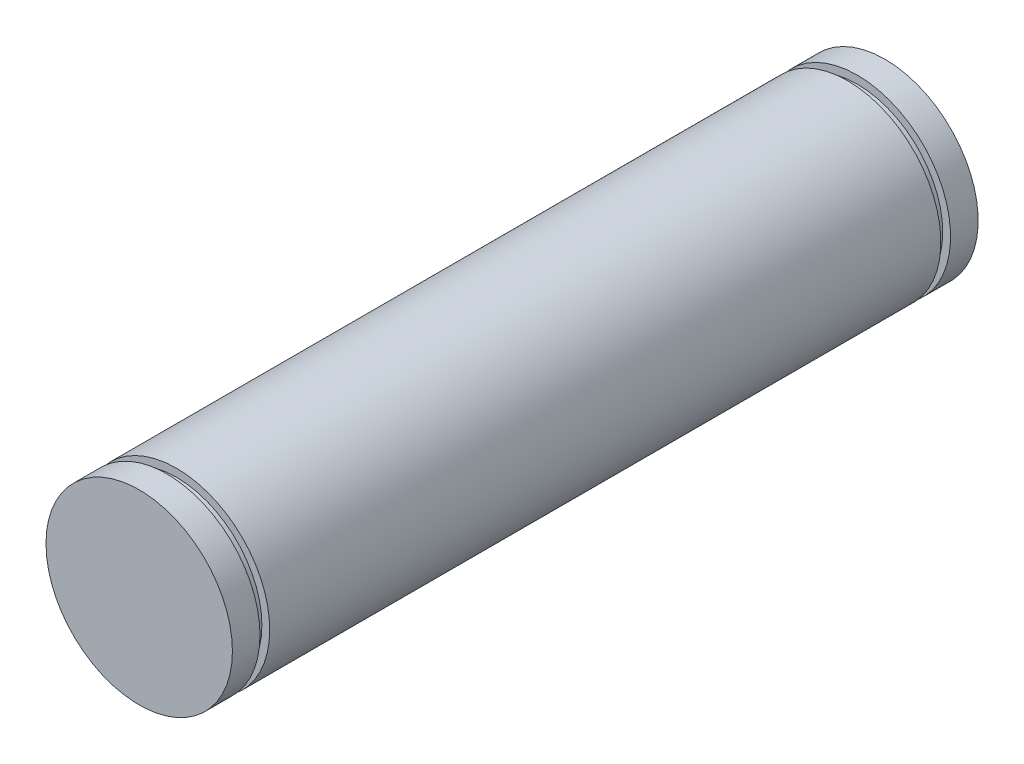
ISO-10303-21;
HEADER;
FILE_DESCRIPTION(('STEP AP214'),'2;1');
FILE_NAME('part.step','',(''),(''),'','','');
FILE_SCHEMA(('AUTOMOTIVE_DESIGN { 1 0 10303 214 1 1 1 1 }'));
ENDSEC;
DATA;
#1=APPLICATION_CONTEXT('core data for automotive mechanical design processes');
#2=APPLICATION_PROTOCOL_DEFINITION('international standard','automotive_design',2000,#1);
#3=PRODUCT_CONTEXT('',#1,'mechanical');
#4=PRODUCT('Part','Part','',(#3));
#5=PRODUCT_RELATED_PRODUCT_CATEGORY('part','',(#4));
#6=PRODUCT_DEFINITION_FORMATION('','',#4);
#7=PRODUCT_DEFINITION_CONTEXT('part definition',#1,'design');
#8=PRODUCT_DEFINITION('design','',#6,#7);
#9=PRODUCT_DEFINITION_SHAPE('','',#8);
#10=(LENGTH_UNIT() NAMED_UNIT(*) SI_UNIT(.MILLI.,.METRE.));
#11=(NAMED_UNIT(*) PLANE_ANGLE_UNIT() SI_UNIT($,.RADIAN.));
#12=(NAMED_UNIT(*) SI_UNIT($,.STERADIAN.) SOLID_ANGLE_UNIT());
#13=UNCERTAINTY_MEASURE_WITH_UNIT(LENGTH_MEASURE(1.E-05),#10,'distance_accuracy_value','');
#14=(GEOMETRIC_REPRESENTATION_CONTEXT(3) GLOBAL_UNCERTAINTY_ASSIGNED_CONTEXT((#13)) GLOBAL_UNIT_ASSIGNED_CONTEXT((#10,
#11,#12)) REPRESENTATION_CONTEXT('',''));
#15=CARTESIAN_POINT('',(0.,0.,0.));
#16=DIRECTION('',(0.,0.,1.));
#17=DIRECTION('',(1.,0.,0.));
#18=AXIS2_PLACEMENT_3D('',#15,#16,#17);
#19=CARTESIAN_POINT('',(1309.32481179939,736.635546362911,5508.00000000001));
#20=DIRECTION('',(0.,0.,-1.));
#21=DIRECTION('',(-1.,0.,0.));
#22=AXIS2_PLACEMENT_3D('',#19,#20,#21);
#23=CYLINDRICAL_SURFACE('',#22,12.5);
#24=CARTESIAN_POINT('',(1309.32481179939,736.635546362911,5503.00000000001));
#25=DIRECTION('',(0.,0.,1.));
#26=DIRECTION('',(1.,0.,0.));
#27=AXIS2_PLACEMENT_3D('',#24,#25,#26);
#28=CIRCLE('',#27,12.5);
#29=CARTESIAN_POINT('',(1321.82481179939,736.635546362911,5503.00000000001));
#30=VERTEX_POINT('',#29);
#31=EDGE_CURVE('E51',#30,#30,#28,.T.);
#32=ORIENTED_EDGE('',*,*,#31,.F.);
#33=EDGE_LOOP('',(#32));
#34=FACE_BOUND('',#33,.T.);
#35=CARTESIAN_POINT('',(1309.32481179939,736.635546362911,5413.));
#36=DIRECTION('',(0.,0.,-1.));
#37=DIRECTION('',(0.,1.,0.));
#38=AXIS2_PLACEMENT_3D('',#35,#36,#37);
#39=CIRCLE('',#38,12.5);
#40=CARTESIAN_POINT('',(1309.32481179939,749.135546362911,5413.));
#41=VERTEX_POINT('',#40);
#42=EDGE_CURVE('E56',#41,#41,#39,.T.);
#43=ORIENTED_EDGE('',*,*,#42,.F.);
#44=EDGE_LOOP('',(#43));
#45=FACE_BOUND('',#44,.T.);
#46=ADVANCED_FACE('F34',(#34,#45),#23,.T.);
#47=CARTESIAN_POINT('',(1309.32481179939,736.635546362911,5504.3));
#48=DIRECTION('',(0.,0.,1.));
#49=DIRECTION('',(1.,0.,0.));
#50=AXIS2_PLACEMENT_3D('',#47,#48,#49);
#51=CIRCLE('',#50,12.5);
#52=CARTESIAN_POINT('',(1321.82481179939,736.635546362911,5504.3));
#53=VERTEX_POINT('',#52);
#54=EDGE_CURVE('E47',#53,#53,#51,.T.);
#55=ORIENTED_EDGE('',*,*,#54,.T.);
#56=EDGE_LOOP('',(#55));
#57=FACE_BOUND('',#56,.T.);
#58=CARTESIAN_POINT('',(1309.32481179939,736.635546362911,5508.00000000001));
#59=DIRECTION('',(0.,0.,1.));
#60=DIRECTION('',(1.,0.,0.));
#61=AXIS2_PLACEMENT_3D('',#58,#59,#60);
#62=CIRCLE('',#61,12.5);
#63=CARTESIAN_POINT('',(1321.82481179939,736.635546362911,5508.00000000001));
#64=VERTEX_POINT('',#63);
#65=EDGE_CURVE('E11',#64,#64,#62,.T.);
#66=ORIENTED_EDGE('',*,*,#65,.F.);
#67=EDGE_LOOP('',(#66));
#68=FACE_BOUND('',#67,.T.);
#69=ADVANCED_FACE('F36',(#57,#68),#23,.T.);
#70=CARTESIAN_POINT('',(1309.32481179939,736.635546362911,5508.00000000001));
#71=DIRECTION('',(0.,0.,1.));
#72=DIRECTION('',(1.,0.,0.));
#73=AXIS2_PLACEMENT_3D('',#70,#71,#72);
#74=PLANE('',#73);
#75=ORIENTED_EDGE('',*,*,#65,.T.);
#76=EDGE_LOOP('',(#75));
#77=FACE_BOUND('',#76,.T.);
#78=ADVANCED_FACE('F90',(#77),#74,.T.);
#79=CARTESIAN_POINT('',(1309.32481179939,736.635546362911,5504.3));
#80=DIRECTION('',(0.,0.,1.));
#81=DIRECTION('',(1.,0.,0.));
#82=AXIS2_PLACEMENT_3D('',#79,#80,#81);
#83=PLANE('',#82);
#84=CARTESIAN_POINT('',(1309.32481179939,736.635546362911,5504.3));
#85=DIRECTION('',(0.,0.,1.));
#86=DIRECTION('',(1.,0.,0.));
#87=AXIS2_PLACEMENT_3D('',#84,#85,#86);
#88=CIRCLE('',#87,11.45);
#89=CARTESIAN_POINT('',(1320.77481179939,736.635546362911,5504.3));
#90=VERTEX_POINT('',#89);
#91=EDGE_CURVE('E54',#90,#90,#88,.T.);
#92=ORIENTED_EDGE('',*,*,#91,.T.);
#93=EDGE_LOOP('',(#92));
#94=FACE_BOUND('',#93,.T.);
#95=ORIENTED_EDGE('',*,*,#54,.F.);
#96=EDGE_LOOP('',(#95));
#97=FACE_BOUND('',#96,.T.);
#98=ADVANCED_FACE('F80',(#94,#97),#83,.F.);
#99=CARTESIAN_POINT('',(1309.32481179939,736.635546362911,5503.00000000001));
#100=DIRECTION('',(0.,0.,1.));
#101=DIRECTION('',(1.,0.,0.));
#102=AXIS2_PLACEMENT_3D('',#99,#100,#101);
#103=PLANE('',#102);
#104=CARTESIAN_POINT('',(1309.32481179939,736.635546362911,5503.00000000001));
#105=DIRECTION('',(0.,0.,1.));
#106=DIRECTION('',(1.,0.,0.));
#107=AXIS2_PLACEMENT_3D('',#104,#105,#106);
#108=CIRCLE('',#107,11.45);
#109=CARTESIAN_POINT('',(1320.77481179939,736.635546362911,5503.00000000001));
#110=VERTEX_POINT('',#109);
#111=EDGE_CURVE('E62',#110,#110,#108,.T.);
#112=ORIENTED_EDGE('',*,*,#111,.F.);
#113=EDGE_LOOP('',(#112));
#114=FACE_BOUND('',#113,.T.);
#115=ORIENTED_EDGE('',*,*,#31,.T.);
#116=EDGE_LOOP('',(#115));
#117=FACE_BOUND('',#116,.T.);
#118=ADVANCED_FACE('F77',(#114,#117),#103,.T.);
#119=CARTESIAN_POINT('',(1309.32481179939,736.635546362911,5504.3));
#120=DIRECTION('',(0.,0.,-1.));
#121=DIRECTION('',(-1.,0.,0.));
#122=AXIS2_PLACEMENT_3D('',#119,#120,#121);
#123=CYLINDRICAL_SURFACE('',#122,11.45);
#124=ORIENTED_EDGE('',*,*,#91,.F.);
#125=EDGE_LOOP('',(#124));
#126=FACE_BOUND('',#125,.T.);
#127=ORIENTED_EDGE('',*,*,#111,.T.);
#128=EDGE_LOOP('',(#127));
#129=FACE_BOUND('',#128,.T.);
#130=ADVANCED_FACE('F75',(#126,#129),#123,.T.);
#131=CARTESIAN_POINT('',(1309.32481179939,736.635546362911,5411.7));
#132=DIRECTION('',(0.,0.,-1.));
#133=DIRECTION('',(0.,1.,0.));
#134=AXIS2_PLACEMENT_3D('',#131,#132,#133);
#135=PLANE('',#134);
#136=CARTESIAN_POINT('',(1309.32481179939,736.635546362911,5411.7));
#137=DIRECTION('',(0.,0.,-1.));
#138=DIRECTION('',(0.,1.,0.));
#139=AXIS2_PLACEMENT_3D('',#136,#137,#138);
#140=CIRCLE('',#139,11.45);
#141=CARTESIAN_POINT('',(1309.32481179939,748.085546362911,5411.7));
#142=VERTEX_POINT('',#141);
#143=EDGE_CURVE('E58',#142,#142,#140,.T.);
#144=ORIENTED_EDGE('',*,*,#143,.T.);
#145=EDGE_LOOP('',(#144));
#146=FACE_BOUND('',#145,.T.);
#147=CARTESIAN_POINT('',(1309.32481179939,736.635546362911,5411.7));
#148=DIRECTION('',(0.,0.,-1.));
#149=DIRECTION('',(0.,1.,0.));
#150=AXIS2_PLACEMENT_3D('',#147,#148,#149);
#151=CIRCLE('',#150,12.5);
#152=CARTESIAN_POINT('',(1309.32481179939,749.135546362911,5411.7));
#153=VERTEX_POINT('',#152);
#154=EDGE_CURVE('E38',#153,#153,#151,.T.);
#155=ORIENTED_EDGE('',*,*,#154,.F.);
#156=EDGE_LOOP('',(#155));
#157=FACE_BOUND('',#156,.T.);
#158=ADVANCED_FACE('F105',(#146,#157),#135,.F.);
#159=CARTESIAN_POINT('',(1309.32481179939,736.635546362911,5413.));
#160=DIRECTION('',(0.,0.,-1.));
#161=DIRECTION('',(0.,1.,0.));
#162=AXIS2_PLACEMENT_3D('',#159,#160,#161);
#163=PLANE('',#162);
#164=CARTESIAN_POINT('',(1309.32481179939,736.635546362911,5413.));
#165=DIRECTION('',(0.,0.,-1.));
#166=DIRECTION('',(0.,1.,0.));
#167=AXIS2_PLACEMENT_3D('',#164,#165,#166);
#168=CIRCLE('',#167,11.45);
#169=CARTESIAN_POINT('',(1309.32481179939,748.085546362911,5413.));
#170=VERTEX_POINT('',#169);
#171=EDGE_CURVE('E64',#170,#170,#168,.T.);
#172=ORIENTED_EDGE('',*,*,#171,.F.);
#173=EDGE_LOOP('',(#172));
#174=FACE_BOUND('',#173,.T.);
#175=ORIENTED_EDGE('',*,*,#42,.T.);
#176=EDGE_LOOP('',(#175));
#177=FACE_BOUND('',#176,.T.);
#178=ADVANCED_FACE('F107',(#174,#177),#163,.T.);
#179=CARTESIAN_POINT('',(1309.32481179939,736.635546362911,5411.7));
#180=DIRECTION('',(0.,0.,1.));
#181=DIRECTION('',(0.,-1.,0.));
#182=AXIS2_PLACEMENT_3D('',#179,#180,#181);
#183=CYLINDRICAL_SURFACE('',#182,11.45);
#184=ORIENTED_EDGE('',*,*,#143,.F.);
#185=EDGE_LOOP('',(#184));
#186=FACE_BOUND('',#185,.T.);
#187=ORIENTED_EDGE('',*,*,#171,.T.);
#188=EDGE_LOOP('',(#187));
#189=FACE_BOUND('',#188,.T.);
#190=ADVANCED_FACE('F98',(#186,#189),#183,.T.);
#191=CARTESIAN_POINT('',(2499.1068218191,1087.08697862823,5408.));
#192=DIRECTION('',(0.,0.,1.));
#193=DIRECTION('',(0.338188044606668,-0.941078554895987,0.));
#194=AXIS2_PLACEMENT_3D('',#191,#192,#193);
#195=PLANE('',#194);
#196=CARTESIAN_POINT('',(1309.32481179939,736.635546362911,5408.));
#197=DIRECTION('',(0.,0.,1.));
#198=DIRECTION('',(0.,-1.,0.));
#199=AXIS2_PLACEMENT_3D('',#196,#197,#198);
#200=CIRCLE('',#199,12.5);
#201=CARTESIAN_POINT('',(1309.32481179939,724.135546362911,5408.));
#202=VERTEX_POINT('',#201);
#203=EDGE_CURVE('E42',#202,#202,#200,.F.);
#204=ORIENTED_EDGE('',*,*,#203,.T.);
#205=EDGE_LOOP('',(#204));
#206=FACE_BOUND('',#205,.T.);
#207=ADVANCED_FACE('F93',(#206),#195,.F.);
#208=ORIENTED_EDGE('',*,*,#154,.T.);
#209=EDGE_LOOP('',(#208));
#210=FACE_BOUND('',#209,.T.);
#211=ORIENTED_EDGE('',*,*,#203,.F.);
#212=EDGE_LOOP('',(#211));
#213=FACE_BOUND('',#212,.T.);
#214=ADVANCED_FACE('F86',(#210,#213),#23,.T.);
#215=CLOSED_SHELL('',(#46,#69,#78,#98,#118,#130,#158,#178,#190,#207,#214));
#216=MANIFOLD_SOLID_BREP('B2',#215);
#217=ADVANCED_BREP_SHAPE_REPRESENTATION('',(#18,#216),#14);
#218=SHAPE_DEFINITION_REPRESENTATION(#9,#217);
ENDSEC;
END-ISO-10303-21;
